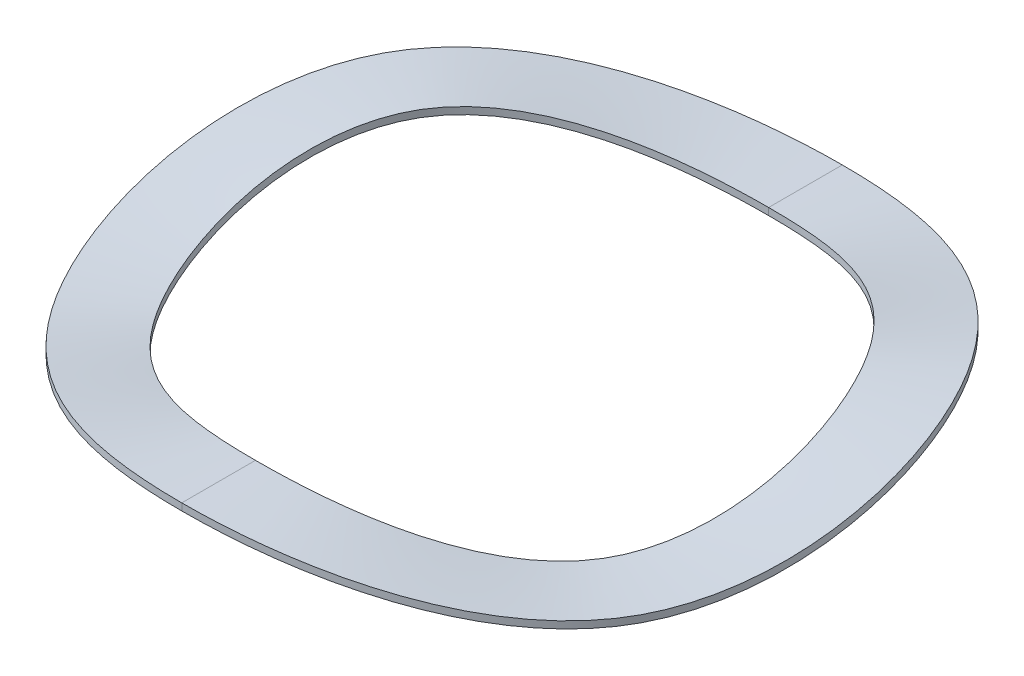
ISO-10303-21;
HEADER;
FILE_DESCRIPTION(('STEP AP214'),'2;1');
FILE_NAME('part.step','',(''),(''),'','','');
FILE_SCHEMA(('AUTOMOTIVE_DESIGN { 1 0 10303 214 1 1 1 1 }'));
ENDSEC;
DATA;
#1=APPLICATION_CONTEXT('core data for automotive mechanical design processes');
#2=APPLICATION_PROTOCOL_DEFINITION('international standard','automotive_design',2000,#1);
#3=PRODUCT_CONTEXT('',#1,'mechanical');
#4=PRODUCT('Part','Part','',(#3));
#5=PRODUCT_RELATED_PRODUCT_CATEGORY('part','',(#4));
#6=PRODUCT_DEFINITION_FORMATION('','',#4);
#7=PRODUCT_DEFINITION_CONTEXT('part definition',#1,'design');
#8=PRODUCT_DEFINITION('design','',#6,#7);
#9=PRODUCT_DEFINITION_SHAPE('','',#8);
#10=(LENGTH_UNIT() NAMED_UNIT(*) SI_UNIT(.MILLI.,.METRE.));
#11=(NAMED_UNIT(*) PLANE_ANGLE_UNIT() SI_UNIT($,.RADIAN.));
#12=(NAMED_UNIT(*) SI_UNIT($,.STERADIAN.) SOLID_ANGLE_UNIT());
#13=UNCERTAINTY_MEASURE_WITH_UNIT(LENGTH_MEASURE(1.E-05),#10,'distance_accuracy_value','');
#14=(GEOMETRIC_REPRESENTATION_CONTEXT(3) GLOBAL_UNCERTAINTY_ASSIGNED_CONTEXT((#13)) GLOBAL_UNIT_ASSIGNED_CONTEXT((#10,
#11,#12)) REPRESENTATION_CONTEXT('',''));
#15=CARTESIAN_POINT('',(0.,0.,0.));
#16=DIRECTION('',(0.,0.,1.));
#17=DIRECTION('',(1.,0.,0.));
#18=AXIS2_PLACEMENT_3D('',#15,#16,#17);
#19=CARTESIAN_POINT('',(0.,0.2921,-10.6553));
#20=CARTESIAN_POINT('',(3.69110419397773,0.2921,-10.6553));
#21=CARTESIAN_POINT('',(11.0733125819332,3.4163,-6.39318));
#22=CARTESIAN_POINT('',(11.0733125819332,-1.27,6.39318));
#23=CARTESIAN_POINT('',(3.69110419397772,1.8542,10.6553));
#24=CARTESIAN_POINT('',(0.,1.8542,10.6553));
#25=CARTESIAN_POINT('',(0.,0.194733333333333,-10.6553));
#26=CARTESIAN_POINT('',(3.69110419397773,0.194733333333332,-10.6553));
#27=CARTESIAN_POINT('',(11.0733125819332,3.31893333333334,-6.39318));
#28=CARTESIAN_POINT('',(11.0733125819332,-1.36736666666666,6.39318));
#29=CARTESIAN_POINT('',(3.69110419397772,1.75683333333333,10.6553));
#30=CARTESIAN_POINT('',(0.,1.75683333333333,10.6553));
#31=CARTESIAN_POINT('',(0.,0.0973666666666658,-10.6553));
#32=CARTESIAN_POINT('',(3.69110419397773,0.0973666666666655,-10.6553));
#33=CARTESIAN_POINT('',(11.0733125819332,3.22156666666667,-6.39318));
#34=CARTESIAN_POINT('',(11.0733125819332,-1.46473333333333,6.39318));
#35=CARTESIAN_POINT('',(3.69110419397772,1.65946666666667,10.6553));
#36=CARTESIAN_POINT('',(0.,1.65946666666667,10.6553));
#37=CARTESIAN_POINT('',(0.,0.,-10.6553));
#38=CARTESIAN_POINT('',(3.69110419397773,0.,-10.6553));
#39=CARTESIAN_POINT('',(11.0733125819332,3.1242,-6.39318));
#40=CARTESIAN_POINT('',(11.0733125819332,-1.5621,6.39318));
#41=CARTESIAN_POINT('',(3.69110419397772,1.5621,10.6553));
#42=CARTESIAN_POINT('',(0.,1.5621,10.6553));
#43=(BOUNDED_SURFACE() B_SPLINE_SURFACE(3,3,((#19,#20,#21,#22,#23,#24),(#25,#26,#27,#28,#29,
#30),(#31,#32,#33,#34,#35,#36),(#37,#38,#39,#40,#41,#42)),.UNSPECIFIED.,.F.,.F.,
.F.) B_SPLINE_SURFACE_WITH_KNOTS((4,4),(4,1,1,4),(0.,1.),(0.,0.166666666666668,
0.333333333333334,0.5),
.UNSPECIFIED.) GEOMETRIC_REPRESENTATION_ITEM() RATIONAL_B_SPLINE_SURFACE(((1.,1.,1.,1.,1.,1.),
(1.,1.,1.,1.,1.,1.),(1.,1.,1.,1.,1.,1.),(1.,1.,1.,1.,1.,1.))) REPRESENTATION_ITEM('') SURFACE());
#44=CARTESIAN_POINT('',(0.,1.8542,10.6553));
#45=CARTESIAN_POINT('',(0.,1.75683333333333,10.6553));
#46=CARTESIAN_POINT('',(0.,1.65946666666667,10.6553));
#47=CARTESIAN_POINT('',(0.,1.5621,10.6553));
#48=(BOUNDED_CURVE() B_SPLINE_CURVE(3,(#44,#45,#46,#47),.UNSPECIFIED.,.F.,
.F.) B_SPLINE_CURVE_WITH_KNOTS((4,4),(0.,1.),
.UNSPECIFIED.) CURVE() GEOMETRIC_REPRESENTATION_ITEM() RATIONAL_B_SPLINE_CURVE((1.,1.,1.,1.)) REPRESENTATION_ITEM(''));
#49=CARTESIAN_POINT('',(0.,1.8542,10.6553));
#50=VERTEX_POINT('',#49);
#51=CARTESIAN_POINT('',(0.,1.5621,10.6553));
#52=VERTEX_POINT('',#51);
#53=EDGE_CURVE('E87',#50,#52,#48,.T.);
#54=CARTESIAN_POINT('',(0.,0.2921,-10.6553));
#55=CARTESIAN_POINT('',(3.69110419397773,0.2921,-10.6553));
#56=CARTESIAN_POINT('',(11.0733125819332,3.4163,-6.39318));
#57=CARTESIAN_POINT('',(11.0733125819332,-1.27,6.39318));
#58=CARTESIAN_POINT('',(3.69110419397772,1.8542,10.6553));
#59=CARTESIAN_POINT('',(0.,1.8542,10.6553));
#60=(BOUNDED_CURVE() B_SPLINE_CURVE(3,(#54,#55,#56,#57,#58,#59),.UNSPECIFIED.,.F.,
.F.) B_SPLINE_CURVE_WITH_KNOTS((4,1,1,4),(0.,0.166666666666668,0.333333333333334,0.5),
.UNSPECIFIED.) CURVE() GEOMETRIC_REPRESENTATION_ITEM() RATIONAL_B_SPLINE_CURVE((1.,1.,1.,1.,1.,1.)) REPRESENTATION_ITEM(''));
#61=CARTESIAN_POINT('',(0.,0.2921,-10.6553));
#62=VERTEX_POINT('',#61);
#63=EDGE_CURVE('E11',#62,#50,#60,.T.);
#64=CARTESIAN_POINT('',(0.,0.2921,-10.6553));
#65=CARTESIAN_POINT('',(0.,0.194733333333333,-10.6553));
#66=CARTESIAN_POINT('',(0.,0.0973666666666658,-10.6553));
#67=CARTESIAN_POINT('',(0.,0.,-10.6553));
#68=(BOUNDED_CURVE() B_SPLINE_CURVE(3,(#64,#65,#66,#67),.UNSPECIFIED.,.F.,
.F.) B_SPLINE_CURVE_WITH_KNOTS((4,4),(0.,1.),
.UNSPECIFIED.) CURVE() GEOMETRIC_REPRESENTATION_ITEM() RATIONAL_B_SPLINE_CURVE((1.,1.,1.,1.)) REPRESENTATION_ITEM(''));
#69=CARTESIAN_POINT('',(0.,0.,-10.6553));
#70=VERTEX_POINT('',#69);
#71=EDGE_CURVE('E95',#62,#70,#68,.T.);
#72=CARTESIAN_POINT('',(0.,0.,-10.6553));
#73=CARTESIAN_POINT('',(3.69110419397773,0.,-10.6553));
#74=CARTESIAN_POINT('',(11.0733125819332,3.1242,-6.39318));
#75=CARTESIAN_POINT('',(11.0733125819332,-1.5621,6.39318));
#76=CARTESIAN_POINT('',(3.69110419397772,1.5621,10.6553));
#77=CARTESIAN_POINT('',(0.,1.5621,10.6553));
#78=(BOUNDED_CURVE() B_SPLINE_CURVE(3,(#72,#73,#74,#75,#76,#77),.UNSPECIFIED.,.F.,
.F.) B_SPLINE_CURVE_WITH_KNOTS((4,1,1,4),(0.,0.166666666666668,0.333333333333334,0.5),
.UNSPECIFIED.) CURVE() GEOMETRIC_REPRESENTATION_ITEM() RATIONAL_B_SPLINE_CURVE((1.,1.,1.,1.,1.,1.)) REPRESENTATION_ITEM(''));
#79=EDGE_CURVE('E31',#70,#52,#78,.T.);
#80=ORIENTED_EDGE('',*,*,#53,.F.);
#81=ORIENTED_EDGE('',*,*,#63,.F.);
#82=ORIENTED_EDGE('',*,*,#71,.T.);
#83=ORIENTED_EDGE('',*,*,#79,.T.);
#84=EDGE_LOOP('',(#80,#81,#82,#83));
#85=FACE_BOUND('',#84,.T.);
#86=ADVANCED_FACE('F17',(#85),#43,.T.);
#87=CARTESIAN_POINT('',(0.,0.2921,-13.716));
#88=CARTESIAN_POINT('',(4.75136177532294,0.2921,-13.716));
#89=CARTESIAN_POINT('',(14.2540853259689,3.4163,-8.2296));
#90=CARTESIAN_POINT('',(14.2540853259688,-1.27,8.2296));
#91=CARTESIAN_POINT('',(4.75136177532294,1.8542,13.716));
#92=CARTESIAN_POINT('',(0.,1.8542,13.716));
#93=CARTESIAN_POINT('',(0.,0.2921,-12.6957666666667));
#94=CARTESIAN_POINT('',(4.3979425815412,0.2921,-12.6957666666667));
#95=CARTESIAN_POINT('',(13.1938277446236,3.4163,-7.61746));
#96=CARTESIAN_POINT('',(13.1938277446236,-1.27,7.61746));
#97=CARTESIAN_POINT('',(4.3979425815412,1.8542,12.6957666666667));
#98=CARTESIAN_POINT('',(0.,1.8542,12.6957666666667));
#99=CARTESIAN_POINT('',(0.,0.2921,-11.6755333333333));
#100=CARTESIAN_POINT('',(4.04452338775946,0.2921,-11.6755333333333));
#101=CARTESIAN_POINT('',(12.1335701632784,3.4163,-7.00532));
#102=CARTESIAN_POINT('',(12.1335701632784,-1.27,7.00532));
#103=CARTESIAN_POINT('',(4.04452338775946,1.8542,11.6755333333333));
#104=CARTESIAN_POINT('',(0.,1.8542,11.6755333333333));
#105=CARTESIAN_POINT('',(0.,0.2921,-10.6553));
#106=CARTESIAN_POINT('',(3.69110419397773,0.2921,-10.6553));
#107=CARTESIAN_POINT('',(11.0733125819332,3.4163,-6.39318));
#108=CARTESIAN_POINT('',(11.0733125819332,-1.27,6.39318));
#109=CARTESIAN_POINT('',(3.69110419397772,1.8542,10.6553));
#110=CARTESIAN_POINT('',(0.,1.8542,10.6553));
#111=(BOUNDED_SURFACE() B_SPLINE_SURFACE(3,3,((#87,#88,#89,#90,#91,#92),(#93,#94,#95,#96,#97,
#98),(#99,#100,#101,#102,#103,#104),(#105,#106,#107,#108,#109,#110)),.UNSPECIFIED.,.F.,.F.,
.F.) B_SPLINE_SURFACE_WITH_KNOTS((4,4),(4,1,1,4),(0.,1.),(0.,0.166666666666668,
0.333333333333334,0.5),
.UNSPECIFIED.) GEOMETRIC_REPRESENTATION_ITEM() RATIONAL_B_SPLINE_SURFACE(((1.,1.,1.,1.,1.,1.),
(1.,1.,1.,1.,1.,1.),(1.,1.,1.,1.,1.,1.),(1.,1.,1.,1.,1.,1.))) REPRESENTATION_ITEM('') SURFACE());
#112=CARTESIAN_POINT('',(0.,1.8542,13.716));
#113=CARTESIAN_POINT('',(0.,1.8542,12.6957666666667));
#114=CARTESIAN_POINT('',(0.,1.8542,11.6755333333333));
#115=CARTESIAN_POINT('',(0.,1.8542,10.6553));
#116=(BOUNDED_CURVE() B_SPLINE_CURVE(3,(#112,#113,#114,#115),.UNSPECIFIED.,.F.,
.F.) B_SPLINE_CURVE_WITH_KNOTS((4,4),(0.,1.),
.UNSPECIFIED.) CURVE() GEOMETRIC_REPRESENTATION_ITEM() RATIONAL_B_SPLINE_CURVE((1.,1.,1.,1.)) REPRESENTATION_ITEM(''));
#117=CARTESIAN_POINT('',(0.,1.8542,13.716));
#118=VERTEX_POINT('',#117);
#119=EDGE_CURVE('E69',#118,#50,#116,.T.);
#120=CARTESIAN_POINT('',(0.,0.2921,-13.716));
#121=CARTESIAN_POINT('',(4.75136177532294,0.2921,-13.716));
#122=CARTESIAN_POINT('',(14.2540853259689,3.4163,-8.2296));
#123=CARTESIAN_POINT('',(14.2540853259688,-1.27,8.2296));
#124=CARTESIAN_POINT('',(4.75136177532294,1.8542,13.716));
#125=CARTESIAN_POINT('',(0.,1.8542,13.716));
#126=(BOUNDED_CURVE() B_SPLINE_CURVE(3,(#120,#121,#122,#123,#124,#125),.UNSPECIFIED.,.F.,
.F.) B_SPLINE_CURVE_WITH_KNOTS((4,1,1,4),(0.,0.166666666666668,0.333333333333334,0.5),
.UNSPECIFIED.) CURVE() GEOMETRIC_REPRESENTATION_ITEM() RATIONAL_B_SPLINE_CURVE((1.,1.,1.,1.,1.,1.)) REPRESENTATION_ITEM(''));
#127=CARTESIAN_POINT('',(0.,0.2921,-13.716));
#128=VERTEX_POINT('',#127);
#129=EDGE_CURVE('E131',#128,#118,#126,.T.);
#130=CARTESIAN_POINT('',(0.,0.2921,-13.716));
#131=CARTESIAN_POINT('',(0.,0.2921,-12.6957666666667));
#132=CARTESIAN_POINT('',(0.,0.2921,-11.6755333333333));
#133=CARTESIAN_POINT('',(0.,0.2921,-10.6553));
#134=(BOUNDED_CURVE() B_SPLINE_CURVE(3,(#130,#131,#132,#133),.UNSPECIFIED.,.F.,
.F.) B_SPLINE_CURVE_WITH_KNOTS((4,4),(0.,1.),
.UNSPECIFIED.) CURVE() GEOMETRIC_REPRESENTATION_ITEM() RATIONAL_B_SPLINE_CURVE((1.,1.,1.,1.)) REPRESENTATION_ITEM(''));
#135=EDGE_CURVE('E72',#128,#62,#134,.T.);
#136=ORIENTED_EDGE('',*,*,#119,.F.);
#137=ORIENTED_EDGE('',*,*,#129,.F.);
#138=ORIENTED_EDGE('',*,*,#135,.T.);
#139=ORIENTED_EDGE('',*,*,#63,.T.);
#140=EDGE_LOOP('',(#136,#137,#138,#139));
#141=FACE_BOUND('',#140,.T.);
#142=ADVANCED_FACE('F67',(#141),#111,.T.);
#143=CARTESIAN_POINT('',(0.,0.,-10.6553));
#144=CARTESIAN_POINT('',(3.69110419397773,0.,-10.6553));
#145=CARTESIAN_POINT('',(11.0733125819332,3.1242,-6.39318));
#146=CARTESIAN_POINT('',(11.0733125819332,-1.5621,6.39318));
#147=CARTESIAN_POINT('',(3.69110419397772,1.5621,10.6553));
#148=CARTESIAN_POINT('',(0.,1.5621,10.6553));
#149=CARTESIAN_POINT('',(0.,0.,-11.6755333333333));
#150=CARTESIAN_POINT('',(4.04452338775946,0.,-11.6755333333333));
#151=CARTESIAN_POINT('',(12.1335701632784,3.1242,-7.00532));
#152=CARTESIAN_POINT('',(12.1335701632784,-1.5621,7.00532));
#153=CARTESIAN_POINT('',(4.04452338775946,1.5621,11.6755333333333));
#154=CARTESIAN_POINT('',(0.,1.5621,11.6755333333333));
#155=CARTESIAN_POINT('',(0.,0.,-12.6957666666667));
#156=CARTESIAN_POINT('',(4.3979425815412,0.,-12.6957666666667));
#157=CARTESIAN_POINT('',(13.1938277446236,3.1242,-7.61746));
#158=CARTESIAN_POINT('',(13.1938277446236,-1.5621,7.61746));
#159=CARTESIAN_POINT('',(4.3979425815412,1.5621,12.6957666666667));
#160=CARTESIAN_POINT('',(0.,1.5621,12.6957666666667));
#161=CARTESIAN_POINT('',(0.,0.,-13.716));
#162=CARTESIAN_POINT('',(4.75136177532294,0.,-13.716));
#163=CARTESIAN_POINT('',(14.2540853259689,3.1242,-8.2296));
#164=CARTESIAN_POINT('',(14.2540853259688,-1.5621,8.2296));
#165=CARTESIAN_POINT('',(4.75136177532294,1.5621,13.716));
#166=CARTESIAN_POINT('',(0.,1.5621,13.716));
#167=(BOUNDED_SURFACE() B_SPLINE_SURFACE(3,3,((#143,#144,#145,#146,#147,#148),(#149,#150,#151,
#152,#153,#154),(#155,#156,#157,#158,#159,#160),(#161,#162,#163,#164,#165,#166)),.UNSPECIFIED.,
.F.,.F.,.F.) B_SPLINE_SURFACE_WITH_KNOTS((4,4),(4,1,1,4),(0.,1.),(0.,0.166666666666668,
0.333333333333334,0.5),
.UNSPECIFIED.) GEOMETRIC_REPRESENTATION_ITEM() RATIONAL_B_SPLINE_SURFACE(((1.,1.,1.,1.,1.,1.),
(1.,1.,1.,1.,1.,1.),(1.,1.,1.,1.,1.,1.),(1.,1.,1.,1.,1.,1.))) REPRESENTATION_ITEM('') SURFACE());
#168=CARTESIAN_POINT('',(0.,1.5621,10.6553));
#169=CARTESIAN_POINT('',(0.,1.5621,11.6755333333333));
#170=CARTESIAN_POINT('',(0.,1.5621,12.6957666666667));
#171=CARTESIAN_POINT('',(0.,1.5621,13.716));
#172=(BOUNDED_CURVE() B_SPLINE_CURVE(3,(#168,#169,#170,#171),.UNSPECIFIED.,.F.,
.F.) B_SPLINE_CURVE_WITH_KNOTS((4,4),(0.,1.),
.UNSPECIFIED.) CURVE() GEOMETRIC_REPRESENTATION_ITEM() RATIONAL_B_SPLINE_CURVE((1.,1.,1.,1.)) REPRESENTATION_ITEM(''));
#173=CARTESIAN_POINT('',(0.,1.5621,13.716));
#174=VERTEX_POINT('',#173);
#175=EDGE_CURVE('E145',#52,#174,#172,.T.);
#176=CARTESIAN_POINT('',(0.,0.,-10.6553));
#177=CARTESIAN_POINT('',(0.,0.,-11.6755333333333));
#178=CARTESIAN_POINT('',(0.,0.,-12.6957666666667));
#179=CARTESIAN_POINT('',(0.,0.,-13.716));
#180=(BOUNDED_CURVE() B_SPLINE_CURVE(3,(#176,#177,#178,#179),.UNSPECIFIED.,.F.,
.F.) B_SPLINE_CURVE_WITH_KNOTS((4,4),(0.,1.),
.UNSPECIFIED.) CURVE() GEOMETRIC_REPRESENTATION_ITEM() RATIONAL_B_SPLINE_CURVE((1.,1.,1.,1.)) REPRESENTATION_ITEM(''));
#181=CARTESIAN_POINT('',(0.,0.,-13.716));
#182=VERTEX_POINT('',#181);
#183=EDGE_CURVE('E130',#70,#182,#180,.T.);
#184=CARTESIAN_POINT('',(0.,1.5621,13.716));
#185=CARTESIAN_POINT('',(4.75136177532294,1.5621,13.716));
#186=CARTESIAN_POINT('',(14.2540853259688,-1.5621,8.2296));
#187=CARTESIAN_POINT('',(14.2540853259689,3.1242,-8.2296));
#188=CARTESIAN_POINT('',(4.75136177532294,0.,-13.716));
#189=CARTESIAN_POINT('',(0.,0.,-13.716));
#190=(BOUNDED_CURVE() B_SPLINE_CURVE(3,(#184,#185,#186,#187,#188,#189),.UNSPECIFIED.,.F.,
.F.) B_SPLINE_CURVE_WITH_KNOTS((4,1,1,4),(0.5,0.666666666666666,0.833333333333333,1.),
.UNSPECIFIED.) CURVE() GEOMETRIC_REPRESENTATION_ITEM() RATIONAL_B_SPLINE_CURVE((1.,1.,1.,1.,1.,1.)) REPRESENTATION_ITEM(''));
#191=EDGE_CURVE('E45',#174,#182,#190,.T.);
#192=ORIENTED_EDGE('',*,*,#175,.F.);
#193=ORIENTED_EDGE('',*,*,#79,.F.);
#194=ORIENTED_EDGE('',*,*,#183,.T.);
#195=ORIENTED_EDGE('',*,*,#191,.F.);
#196=EDGE_LOOP('',(#192,#193,#194,#195));
#197=FACE_BOUND('',#196,.T.);
#198=ADVANCED_FACE('F197',(#197),#167,.T.);
#199=CARTESIAN_POINT('',(0.,0.,-13.716));
#200=CARTESIAN_POINT('',(4.75136177532294,0.,-13.716));
#201=CARTESIAN_POINT('',(14.2540853259689,3.1242,-8.2296));
#202=CARTESIAN_POINT('',(14.2540853259688,-1.5621,8.2296));
#203=CARTESIAN_POINT('',(4.75136177532294,1.5621,13.716));
#204=CARTESIAN_POINT('',(0.,1.5621,13.716));
#205=CARTESIAN_POINT('',(0.,0.0973666666666665,-13.716));
#206=CARTESIAN_POINT('',(4.75136177532294,0.0973666666666662,-13.716));
#207=CARTESIAN_POINT('',(14.2540853259689,3.22156666666667,-8.2296));
#208=CARTESIAN_POINT('',(14.2540853259688,-1.46473333333333,8.2296));
#209=CARTESIAN_POINT('',(4.75136177532294,1.65946666666667,13.716));
#210=CARTESIAN_POINT('',(0.,1.65946666666667,13.716));
#211=CARTESIAN_POINT('',(0.,0.194733333333333,-13.716));
#212=CARTESIAN_POINT('',(4.75136177532294,0.194733333333333,-13.716));
#213=CARTESIAN_POINT('',(14.2540853259689,3.31893333333334,-8.2296));
#214=CARTESIAN_POINT('',(14.2540853259688,-1.36736666666666,8.2296));
#215=CARTESIAN_POINT('',(4.75136177532294,1.75683333333333,13.716));
#216=CARTESIAN_POINT('',(0.,1.75683333333333,13.716));
#217=CARTESIAN_POINT('',(0.,0.2921,-13.716));
#218=CARTESIAN_POINT('',(4.75136177532294,0.2921,-13.716));
#219=CARTESIAN_POINT('',(14.2540853259689,3.4163,-8.2296));
#220=CARTESIAN_POINT('',(14.2540853259688,-1.27,8.2296));
#221=CARTESIAN_POINT('',(4.75136177532294,1.8542,13.716));
#222=CARTESIAN_POINT('',(0.,1.8542,13.716));
#223=(BOUNDED_SURFACE() B_SPLINE_SURFACE(3,3,((#199,#200,#201,#202,#203,#204),(#205,#206,#207,
#208,#209,#210),(#211,#212,#213,#214,#215,#216),(#217,#218,#219,#220,#221,#222)),.UNSPECIFIED.,
.F.,.F.,.F.) B_SPLINE_SURFACE_WITH_KNOTS((4,4),(4,1,1,4),(0.,1.),(0.,0.166666666666668,
0.333333333333334,0.5),
.UNSPECIFIED.) GEOMETRIC_REPRESENTATION_ITEM() RATIONAL_B_SPLINE_SURFACE(((1.,1.,1.,1.,1.,1.),
(1.,1.,1.,1.,1.,1.),(1.,1.,1.,1.,1.,1.),(1.,1.,1.,1.,1.,1.))) REPRESENTATION_ITEM('') SURFACE());
#224=CARTESIAN_POINT('',(0.,1.5621,13.716));
#225=CARTESIAN_POINT('',(0.,1.65946666666667,13.716));
#226=CARTESIAN_POINT('',(0.,1.75683333333333,13.716));
#227=CARTESIAN_POINT('',(0.,1.8542,13.716));
#228=(BOUNDED_CURVE() B_SPLINE_CURVE(3,(#224,#225,#226,#227),.UNSPECIFIED.,.F.,
.F.) B_SPLINE_CURVE_WITH_KNOTS((4,4),(0.,1.),
.UNSPECIFIED.) CURVE() GEOMETRIC_REPRESENTATION_ITEM() RATIONAL_B_SPLINE_CURVE((1.,1.,1.,1.)) REPRESENTATION_ITEM(''));
#229=EDGE_CURVE('E121',#174,#118,#228,.T.);
#230=CARTESIAN_POINT('',(0.,0.,-13.716));
#231=CARTESIAN_POINT('',(0.,0.0973666666666665,-13.716));
#232=CARTESIAN_POINT('',(0.,0.194733333333333,-13.716));
#233=CARTESIAN_POINT('',(0.,0.2921,-13.716));
#234=(BOUNDED_CURVE() B_SPLINE_CURVE(3,(#230,#231,#232,#233),.UNSPECIFIED.,.F.,
.F.) B_SPLINE_CURVE_WITH_KNOTS((4,4),(0.,1.),
.UNSPECIFIED.) CURVE() GEOMETRIC_REPRESENTATION_ITEM() RATIONAL_B_SPLINE_CURVE((1.,1.,1.,1.)) REPRESENTATION_ITEM(''));
#235=EDGE_CURVE('E113',#182,#128,#234,.T.);
#236=ORIENTED_EDGE('',*,*,#229,.F.);
#237=ORIENTED_EDGE('',*,*,#191,.T.);
#238=ORIENTED_EDGE('',*,*,#235,.T.);
#239=ORIENTED_EDGE('',*,*,#129,.T.);
#240=EDGE_LOOP('',(#236,#237,#238,#239));
#241=FACE_BOUND('',#240,.T.);
#242=ADVANCED_FACE('F201',(#241),#223,.T.);
#243=CARTESIAN_POINT('',(0.,1.5621,13.716));
#244=CARTESIAN_POINT('',(-4.75136177532294,1.5621,13.716));
#245=CARTESIAN_POINT('',(-14.2540853259689,-1.5621,8.2296));
#246=CARTESIAN_POINT('',(-14.2540853259688,1.5621,-2.74320000000006));
#247=CARTESIAN_POINT('',(-9.50272355064585,1.5621,-10.9728));
#248=CARTESIAN_POINT('',(-4.75136177532294,0.,-13.716));
#249=CARTESIAN_POINT('',(0.,0.,-13.716));
#250=CARTESIAN_POINT('',(0.,1.65946666666667,13.716));
#251=CARTESIAN_POINT('',(-4.75136177532294,1.65946666666667,13.716));
#252=CARTESIAN_POINT('',(-14.2540853259689,-1.46473333333333,8.2296));
#253=CARTESIAN_POINT('',(-14.2540853259688,1.65946666666667,-2.74320000000006));
#254=CARTESIAN_POINT('',(-9.50272355064585,1.65946666666667,-10.9728));
#255=CARTESIAN_POINT('',(-4.75136177532294,0.0973666666666667,-13.716));
#256=CARTESIAN_POINT('',(0.,0.0973666666666665,-13.716));
#257=CARTESIAN_POINT('',(0.,1.75683333333333,13.716));
#258=CARTESIAN_POINT('',(-4.75136177532294,1.75683333333333,13.716));
#259=CARTESIAN_POINT('',(-14.2540853259689,-1.36736666666666,8.2296));
#260=CARTESIAN_POINT('',(-14.2540853259688,1.75683333333333,-2.74320000000006));
#261=CARTESIAN_POINT('',(-9.50272355064585,1.75683333333333,-10.9728));
#262=CARTESIAN_POINT('',(-4.75136177532294,0.194733333333333,-13.716));
#263=CARTESIAN_POINT('',(0.,0.194733333333333,-13.716));
#264=CARTESIAN_POINT('',(0.,1.8542,13.716));
#265=CARTESIAN_POINT('',(-4.75136177532294,1.8542,13.716));
#266=CARTESIAN_POINT('',(-14.2540853259689,-1.27,8.2296));
#267=CARTESIAN_POINT('',(-14.2540853259688,1.8542,-2.74320000000006));
#268=CARTESIAN_POINT('',(-9.50272355064585,1.8542,-10.9728));
#269=CARTESIAN_POINT('',(-4.75136177532294,0.2921,-13.716));
#270=CARTESIAN_POINT('',(0.,0.2921,-13.716));
#271=(BOUNDED_SURFACE() B_SPLINE_SURFACE(3,3,((#243,#244,#245,#246,#247,#248,#249),(#250,#251,
#252,#253,#254,#255,#256),(#257,#258,#259,#260,#261,#262,#263),(#264,#265,#266,#267,#268,#269,
#270)),.UNSPECIFIED.,.F.,.F.,.F.) B_SPLINE_SURFACE_WITH_KNOTS((4,4),(4,1,2,4),(0.,1.),(0.5,
0.666666666666666,0.833333333333333,1.),
.UNSPECIFIED.) GEOMETRIC_REPRESENTATION_ITEM() RATIONAL_B_SPLINE_SURFACE(((1.,1.,1.,1.,1.,1.,
1.),(1.,1.,1.,1.,1.,1.,1.),(1.,1.,1.,1.,1.,1.,1.),(1.,1.,1.,1.,1.,1.,1.))) REPRESENTATION_ITEM('') SURFACE());
#272=CARTESIAN_POINT('',(0.,0.,-13.716));
#273=CARTESIAN_POINT('',(-4.75136177532294,0.,-13.716));
#274=CARTESIAN_POINT('',(-9.50272355064585,1.5621,-10.9728));
#275=CARTESIAN_POINT('',(-14.2540853259688,1.5621,-2.74320000000006));
#276=CARTESIAN_POINT('',(-14.2540853259689,-1.5621,8.2296));
#277=CARTESIAN_POINT('',(-4.75136177532294,1.5621,13.716));
#278=CARTESIAN_POINT('',(0.,1.5621,13.716));
#279=(BOUNDED_CURVE() B_SPLINE_CURVE(3,(#272,#273,#274,#275,#276,#277,#278),.UNSPECIFIED.,.F.,
.F.) B_SPLINE_CURVE_WITH_KNOTS((4,2,1,4),(0.,0.166666666666667,0.333333333333334,0.5),
.UNSPECIFIED.) CURVE() GEOMETRIC_REPRESENTATION_ITEM() RATIONAL_B_SPLINE_CURVE((1.,1.,1.,1.,1.,
1.,1.)) REPRESENTATION_ITEM(''));
#280=EDGE_CURVE('E153',#182,#174,#279,.T.);
#281=CARTESIAN_POINT('',(0.,1.8542,13.716));
#282=CARTESIAN_POINT('',(-4.75136177532294,1.8542,13.716));
#283=CARTESIAN_POINT('',(-14.2540853259689,-1.27,8.2296));
#284=CARTESIAN_POINT('',(-14.2540853259688,1.8542,-2.74320000000006));
#285=CARTESIAN_POINT('',(-9.50272355064585,1.8542,-10.9728));
#286=CARTESIAN_POINT('',(-4.75136177532294,0.2921,-13.716));
#287=CARTESIAN_POINT('',(0.,0.2921,-13.716));
#288=(BOUNDED_CURVE() B_SPLINE_CURVE(3,(#281,#282,#283,#284,#285,#286,#287),.UNSPECIFIED.,.F.,
.F.) B_SPLINE_CURVE_WITH_KNOTS((4,1,2,4),(0.5,0.666666666666666,0.833333333333333,1.),
.UNSPECIFIED.) CURVE() GEOMETRIC_REPRESENTATION_ITEM() RATIONAL_B_SPLINE_CURVE((1.,1.,1.,1.,1.,
1.,1.)) REPRESENTATION_ITEM(''));
#289=EDGE_CURVE('E83',#118,#128,#288,.T.);
#290=ORIENTED_EDGE('',*,*,#280,.T.);
#291=ORIENTED_EDGE('',*,*,#229,.T.);
#292=ORIENTED_EDGE('',*,*,#289,.T.);
#293=ORIENTED_EDGE('',*,*,#235,.F.);
#294=EDGE_LOOP('',(#290,#291,#292,#293));
#295=FACE_BOUND('',#294,.T.);
#296=ADVANCED_FACE('F200',(#295),#271,.T.);
#297=CARTESIAN_POINT('',(0.,1.5621,10.6553));
#298=CARTESIAN_POINT('',(-3.69110419397773,1.5621,10.6553));
#299=CARTESIAN_POINT('',(-11.0733125819332,-1.5621,6.39318));
#300=CARTESIAN_POINT('',(-11.0733125819332,1.5621,-2.13106000000005));
#301=CARTESIAN_POINT('',(-7.38220838795543,1.5621,-8.52424));
#302=CARTESIAN_POINT('',(-3.69110419397772,0.,-10.6553));
#303=CARTESIAN_POINT('',(0.,0.,-10.6553));
#304=CARTESIAN_POINT('',(0.,1.5621,11.6755333333333));
#305=CARTESIAN_POINT('',(-4.04452338775947,1.5621,11.6755333333333));
#306=CARTESIAN_POINT('',(-12.1335701632785,-1.5621,7.00532));
#307=CARTESIAN_POINT('',(-12.1335701632784,1.5621,-2.33510666666672));
#308=CARTESIAN_POINT('',(-8.08904677551891,1.5621,-9.34042666666671));
#309=CARTESIAN_POINT('',(-4.04452338775946,0.,-11.6755333333333));
#310=CARTESIAN_POINT('',(0.,0.,-11.6755333333333));
#311=CARTESIAN_POINT('',(0.,1.5621,12.6957666666667));
#312=CARTESIAN_POINT('',(-4.3979425815412,1.5621,12.6957666666667));
#313=CARTESIAN_POINT('',(-13.1938277446237,-1.5621,7.61746));
#314=CARTESIAN_POINT('',(-13.1938277446236,1.5621,-2.53915333333339));
#315=CARTESIAN_POINT('',(-8.79588516308238,1.5621,-10.1566133333334));
#316=CARTESIAN_POINT('',(-4.3979425815412,0.,-12.6957666666667));
#317=CARTESIAN_POINT('',(0.,0.,-12.6957666666667));
#318=CARTESIAN_POINT('',(0.,1.5621,13.716));
#319=CARTESIAN_POINT('',(-4.75136177532294,1.5621,13.716));
#320=CARTESIAN_POINT('',(-14.2540853259689,-1.5621,8.2296));
#321=CARTESIAN_POINT('',(-14.2540853259688,1.5621,-2.74320000000006));
#322=CARTESIAN_POINT('',(-9.50272355064585,1.5621,-10.9728));
#323=CARTESIAN_POINT('',(-4.75136177532294,0.,-13.716));
#324=CARTESIAN_POINT('',(0.,0.,-13.716));
#325=(BOUNDED_SURFACE() B_SPLINE_SURFACE(3,3,((#297,#298,#299,#300,#301,#302,#303),(#304,#305,
#306,#307,#308,#309,#310),(#311,#312,#313,#314,#315,#316,#317),(#318,#319,#320,#321,#322,#323,
#324)),.UNSPECIFIED.,.F.,.F.,.F.) B_SPLINE_SURFACE_WITH_KNOTS((4,4),(4,1,2,4),(0.,1.),(0.5,
0.666666666666666,0.833333333333333,1.),
.UNSPECIFIED.) GEOMETRIC_REPRESENTATION_ITEM() RATIONAL_B_SPLINE_SURFACE(((1.,1.,1.,1.,1.,1.,
1.),(1.,1.,1.,1.,1.,1.,1.),(1.,1.,1.,1.,1.,1.,1.),(1.,1.,1.,1.,1.,1.,1.))) REPRESENTATION_ITEM('') SURFACE());
#326=CARTESIAN_POINT('',(0.,1.5621,10.6553));
#327=CARTESIAN_POINT('',(-3.69110419397773,1.5621,10.6553));
#328=CARTESIAN_POINT('',(-11.0733125819332,-1.5621,6.39318));
#329=CARTESIAN_POINT('',(-11.0733125819332,1.5621,-2.13106000000005));
#330=CARTESIAN_POINT('',(-7.38220838795543,1.5621,-8.52424));
#331=CARTESIAN_POINT('',(-3.69110419397772,0.,-10.6553));
#332=CARTESIAN_POINT('',(0.,0.,-10.6553));
#333=(BOUNDED_CURVE() B_SPLINE_CURVE(3,(#326,#327,#328,#329,#330,#331,#332),.UNSPECIFIED.,.F.,
.F.) B_SPLINE_CURVE_WITH_KNOTS((4,1,2,4),(0.5,0.666666666666666,0.833333333333333,1.),
.UNSPECIFIED.) CURVE() GEOMETRIC_REPRESENTATION_ITEM() RATIONAL_B_SPLINE_CURVE((1.,1.,1.,1.,1.,
1.,1.)) REPRESENTATION_ITEM(''));
#334=EDGE_CURVE('E93',#52,#70,#333,.T.);
#335=ORIENTED_EDGE('',*,*,#334,.F.);
#336=ORIENTED_EDGE('',*,*,#175,.T.);
#337=ORIENTED_EDGE('',*,*,#280,.F.);
#338=ORIENTED_EDGE('',*,*,#183,.F.);
#339=EDGE_LOOP('',(#335,#336,#337,#338));
#340=FACE_BOUND('',#339,.T.);
#341=ADVANCED_FACE('F198',(#340),#325,.T.);
#342=CARTESIAN_POINT('',(0.,1.8542,13.716));
#343=CARTESIAN_POINT('',(-4.75136177532294,1.8542,13.716));
#344=CARTESIAN_POINT('',(-14.2540853259689,-1.27,8.2296));
#345=CARTESIAN_POINT('',(-14.2540853259688,1.8542,-2.74320000000006));
#346=CARTESIAN_POINT('',(-9.50272355064585,1.8542,-10.9728));
#347=CARTESIAN_POINT('',(-4.75136177532294,0.2921,-13.716));
#348=CARTESIAN_POINT('',(0.,0.2921,-13.716));
#349=CARTESIAN_POINT('',(0.,1.8542,12.6957666666667));
#350=CARTESIAN_POINT('',(-4.3979425815412,1.8542,12.6957666666667));
#351=CARTESIAN_POINT('',(-13.1938277446237,-1.27,7.61746));
#352=CARTESIAN_POINT('',(-13.1938277446236,1.8542,-2.53915333333339));
#353=CARTESIAN_POINT('',(-8.79588516308238,1.8542,-10.1566133333334));
#354=CARTESIAN_POINT('',(-4.3979425815412,0.2921,-12.6957666666667));
#355=CARTESIAN_POINT('',(0.,0.2921,-12.6957666666667));
#356=CARTESIAN_POINT('',(0.,1.8542,11.6755333333333));
#357=CARTESIAN_POINT('',(-4.04452338775947,1.8542,11.6755333333333));
#358=CARTESIAN_POINT('',(-12.1335701632785,-1.27,7.00532));
#359=CARTESIAN_POINT('',(-12.1335701632784,1.8542,-2.33510666666672));
#360=CARTESIAN_POINT('',(-8.08904677551891,1.8542,-9.34042666666671));
#361=CARTESIAN_POINT('',(-4.04452338775946,0.2921,-11.6755333333333));
#362=CARTESIAN_POINT('',(0.,0.2921,-11.6755333333333));
#363=CARTESIAN_POINT('',(0.,1.8542,10.6553));
#364=CARTESIAN_POINT('',(-3.69110419397773,1.8542,10.6553));
#365=CARTESIAN_POINT('',(-11.0733125819332,-1.27,6.39318));
#366=CARTESIAN_POINT('',(-11.0733125819332,1.8542,-2.13106000000005));
#367=CARTESIAN_POINT('',(-7.38220838795543,1.8542,-8.52424));
#368=CARTESIAN_POINT('',(-3.69110419397772,0.2921,-10.6553));
#369=CARTESIAN_POINT('',(0.,0.2921,-10.6553));
#370=(BOUNDED_SURFACE() B_SPLINE_SURFACE(3,3,((#342,#343,#344,#345,#346,#347,#348),(#349,#350,
#351,#352,#353,#354,#355),(#356,#357,#358,#359,#360,#361,#362),(#363,#364,#365,#366,#367,#368,
#369)),.UNSPECIFIED.,.F.,.F.,.F.) B_SPLINE_SURFACE_WITH_KNOTS((4,4),(4,1,2,4),(0.,1.),(0.5,
0.666666666666666,0.833333333333333,1.),
.UNSPECIFIED.) GEOMETRIC_REPRESENTATION_ITEM() RATIONAL_B_SPLINE_SURFACE(((1.,1.,1.,1.,1.,1.,
1.),(1.,1.,1.,1.,1.,1.,1.),(1.,1.,1.,1.,1.,1.,1.),(1.,1.,1.,1.,1.,1.,1.))) REPRESENTATION_ITEM('') SURFACE());
#371=CARTESIAN_POINT('',(0.,1.8542,10.6553));
#372=CARTESIAN_POINT('',(-3.69110419397773,1.8542,10.6553));
#373=CARTESIAN_POINT('',(-11.0733125819332,-1.27,6.39318));
#374=CARTESIAN_POINT('',(-11.0733125819332,1.8542,-2.13106000000005));
#375=CARTESIAN_POINT('',(-7.38220838795543,1.8542,-8.52424));
#376=CARTESIAN_POINT('',(-3.69110419397772,0.2921,-10.6553));
#377=CARTESIAN_POINT('',(0.,0.2921,-10.6553));
#378=(BOUNDED_CURVE() B_SPLINE_CURVE(3,(#371,#372,#373,#374,#375,#376,#377),.UNSPECIFIED.,.F.,
.F.) B_SPLINE_CURVE_WITH_KNOTS((4,1,2,4),(0.5,0.666666666666666,0.833333333333333,1.),
.UNSPECIFIED.) CURVE() GEOMETRIC_REPRESENTATION_ITEM() RATIONAL_B_SPLINE_CURVE((1.,1.,1.,1.,1.,
1.,1.)) REPRESENTATION_ITEM(''));
#379=EDGE_CURVE('E81',#50,#62,#378,.T.);
#380=ORIENTED_EDGE('',*,*,#289,.F.);
#381=ORIENTED_EDGE('',*,*,#119,.T.);
#382=ORIENTED_EDGE('',*,*,#379,.T.);
#383=ORIENTED_EDGE('',*,*,#135,.F.);
#384=EDGE_LOOP('',(#380,#381,#382,#383));
#385=FACE_BOUND('',#384,.T.);
#386=ADVANCED_FACE('F79',(#385),#370,.T.);
#387=CARTESIAN_POINT('',(0.,1.8542,10.6553));
#388=CARTESIAN_POINT('',(-3.69110419397773,1.8542,10.6553));
#389=CARTESIAN_POINT('',(-11.0733125819332,-1.27,6.39318));
#390=CARTESIAN_POINT('',(-11.0733125819332,1.8542,-2.13106000000005));
#391=CARTESIAN_POINT('',(-7.38220838795543,1.8542,-8.52424));
#392=CARTESIAN_POINT('',(-3.69110419397772,0.2921,-10.6553));
#393=CARTESIAN_POINT('',(0.,0.2921,-10.6553));
#394=CARTESIAN_POINT('',(0.,1.75683333333333,10.6553));
#395=CARTESIAN_POINT('',(-3.69110419397773,1.75683333333333,10.6553));
#396=CARTESIAN_POINT('',(-11.0733125819332,-1.36736666666667,6.39318));
#397=CARTESIAN_POINT('',(-11.0733125819332,1.75683333333333,-2.13106000000005));
#398=CARTESIAN_POINT('',(-7.38220838795543,1.75683333333333,-8.52424));
#399=CARTESIAN_POINT('',(-3.69110419397772,0.194733333333333,-10.6553));
#400=CARTESIAN_POINT('',(0.,0.194733333333333,-10.6553));
#401=CARTESIAN_POINT('',(0.,1.65946666666667,10.6553));
#402=CARTESIAN_POINT('',(-3.69110419397773,1.65946666666667,10.6553));
#403=CARTESIAN_POINT('',(-11.0733125819332,-1.46473333333333,6.39318));
#404=CARTESIAN_POINT('',(-11.0733125819332,1.65946666666667,-2.13106000000005));
#405=CARTESIAN_POINT('',(-7.38220838795543,1.65946666666667,-8.52424));
#406=CARTESIAN_POINT('',(-3.69110419397772,0.0973666666666661,-10.6553));
#407=CARTESIAN_POINT('',(0.,0.0973666666666658,-10.6553));
#408=CARTESIAN_POINT('',(0.,1.5621,10.6553));
#409=CARTESIAN_POINT('',(-3.69110419397773,1.5621,10.6553));
#410=CARTESIAN_POINT('',(-11.0733125819332,-1.5621,6.39318));
#411=CARTESIAN_POINT('',(-11.0733125819332,1.5621,-2.13106000000005));
#412=CARTESIAN_POINT('',(-7.38220838795543,1.5621,-8.52424));
#413=CARTESIAN_POINT('',(-3.69110419397772,0.,-10.6553));
#414=CARTESIAN_POINT('',(0.,0.,-10.6553));
#415=(BOUNDED_SURFACE() B_SPLINE_SURFACE(3,3,((#387,#388,#389,#390,#391,#392,#393),(#394,#395,
#396,#397,#398,#399,#400),(#401,#402,#403,#404,#405,#406,#407),(#408,#409,#410,#411,#412,#413,
#414)),.UNSPECIFIED.,.F.,.F.,.F.) B_SPLINE_SURFACE_WITH_KNOTS((4,4),(4,1,2,4),(0.,1.),(0.5,
0.666666666666666,0.833333333333333,1.),
.UNSPECIFIED.) GEOMETRIC_REPRESENTATION_ITEM() RATIONAL_B_SPLINE_SURFACE(((1.,1.,1.,1.,1.,1.,
1.),(1.,1.,1.,1.,1.,1.,1.),(1.,1.,1.,1.,1.,1.,1.),(1.,1.,1.,1.,1.,1.,1.))) REPRESENTATION_ITEM('') SURFACE());
#416=ORIENTED_EDGE('',*,*,#379,.F.);
#417=ORIENTED_EDGE('',*,*,#53,.T.);
#418=ORIENTED_EDGE('',*,*,#334,.T.);
#419=ORIENTED_EDGE('',*,*,#71,.F.);
#420=EDGE_LOOP('',(#416,#417,#418,#419));
#421=FACE_BOUND('',#420,.T.);
#422=ADVANCED_FACE('F19',(#421),#415,.T.);
#423=CLOSED_SHELL('',(#86,#142,#198,#242,#296,#341,#386,#422));
#424=MANIFOLD_SOLID_BREP('B1',#423);
#425=ADVANCED_BREP_SHAPE_REPRESENTATION('',(#18,#424),#14);
#426=SHAPE_DEFINITION_REPRESENTATION(#9,#425);
ENDSEC;
END-ISO-10303-21;
